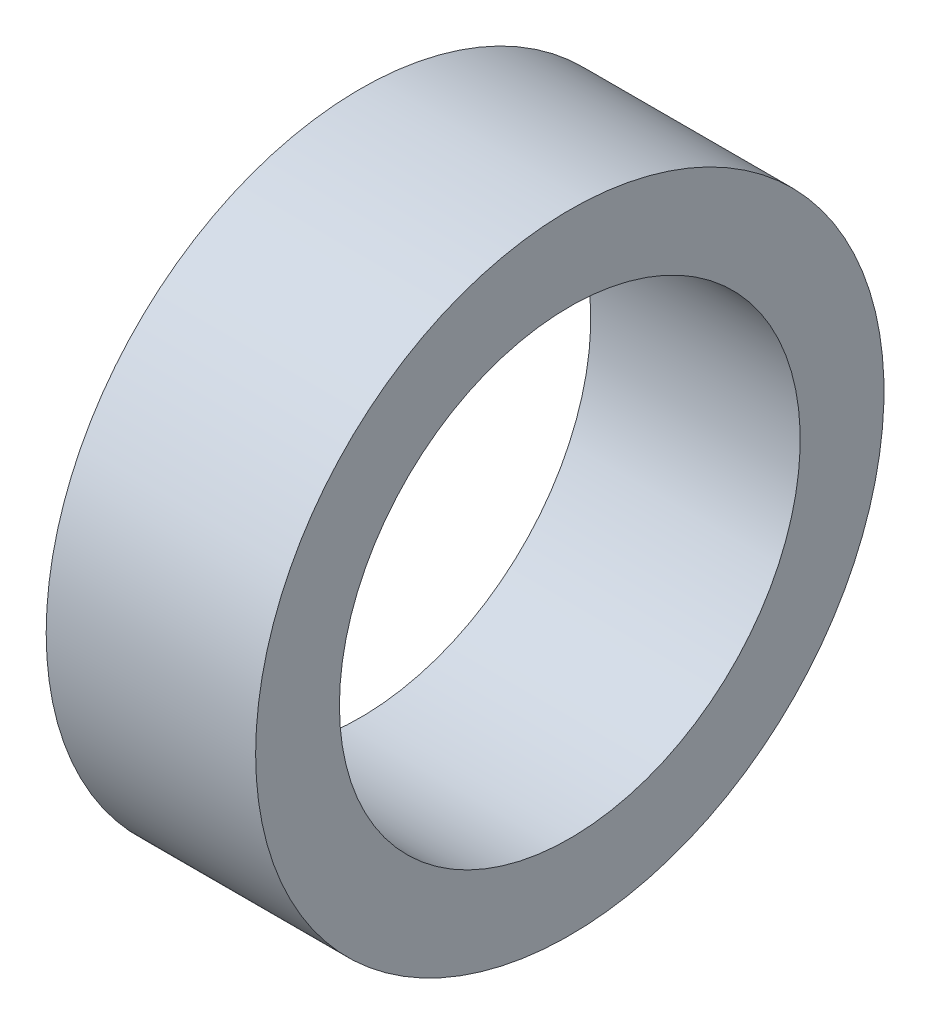
ISO-10303-21;
HEADER;
FILE_DESCRIPTION(('STEP AP214'),'2;1');
FILE_NAME('part.step','',(''),(''),'','','');
FILE_SCHEMA(('AUTOMOTIVE_DESIGN { 1 0 10303 214 1 1 1 1 }'));
ENDSEC;
DATA;
#1=APPLICATION_CONTEXT('core data for automotive mechanical design processes');
#2=APPLICATION_PROTOCOL_DEFINITION('international standard','automotive_design',2000,#1);
#3=PRODUCT_CONTEXT('',#1,'mechanical');
#4=PRODUCT('Part','Part','',(#3));
#5=PRODUCT_RELATED_PRODUCT_CATEGORY('part','',(#4));
#6=PRODUCT_DEFINITION_FORMATION('','',#4);
#7=PRODUCT_DEFINITION_CONTEXT('part definition',#1,'design');
#8=PRODUCT_DEFINITION('design','',#6,#7);
#9=PRODUCT_DEFINITION_SHAPE('','',#8);
#10=(LENGTH_UNIT() NAMED_UNIT(*) SI_UNIT(.MILLI.,.METRE.));
#11=(NAMED_UNIT(*) PLANE_ANGLE_UNIT() SI_UNIT($,.RADIAN.));
#12=(NAMED_UNIT(*) SI_UNIT($,.STERADIAN.) SOLID_ANGLE_UNIT());
#13=UNCERTAINTY_MEASURE_WITH_UNIT(LENGTH_MEASURE(1.E-05),#10,'distance_accuracy_value','');
#14=(GEOMETRIC_REPRESENTATION_CONTEXT(3) GLOBAL_UNCERTAINTY_ASSIGNED_CONTEXT((#13)) GLOBAL_UNIT_ASSIGNED_CONTEXT((#10,
#11,#12)) REPRESENTATION_CONTEXT('',''));
#15=CARTESIAN_POINT('',(0.,0.,0.));
#16=DIRECTION('',(0.,0.,1.));
#17=DIRECTION('',(1.,0.,0.));
#18=AXIS2_PLACEMENT_3D('',#15,#16,#17);
#19=CARTESIAN_POINT('',(-13.97,0.,0.));
#20=DIRECTION('',(-1.,0.,0.));
#21=DIRECTION('',(0.,0.,1.));
#22=AXIS2_PLACEMENT_3D('',#19,#20,#21);
#23=CYLINDRICAL_SURFACE('',#22,38.1);
#24=CARTESIAN_POINT('',(-12.7,0.,0.));
#25=DIRECTION('',(-1.,0.,0.));
#26=DIRECTION('',(0.,0.,1.));
#27=AXIS2_PLACEMENT_3D('',#24,#25,#26);
#28=CIRCLE('',#27,38.1);
#29=CARTESIAN_POINT('',(-12.7,0.,38.1));
#30=VERTEX_POINT('',#29);
#31=EDGE_CURVE('E10',#30,#30,#28,.T.);
#32=ORIENTED_EDGE('',*,*,#31,.F.);
#33=EDGE_LOOP('',(#32));
#34=FACE_BOUND('',#33,.T.);
#35=CARTESIAN_POINT('',(12.7,0.,0.));
#36=DIRECTION('',(-1.,0.,0.));
#37=DIRECTION('',(0.,0.,1.));
#38=AXIS2_PLACEMENT_3D('',#35,#36,#37);
#39=CIRCLE('',#38,38.1);
#40=CARTESIAN_POINT('',(12.7,0.,38.1));
#41=VERTEX_POINT('',#40);
#42=EDGE_CURVE('E53',#41,#41,#39,.T.);
#43=ORIENTED_EDGE('',*,*,#42,.T.);
#44=EDGE_LOOP('',(#43));
#45=FACE_BOUND('',#44,.T.);
#46=ADVANCED_FACE('F39',(#34,#45),#23,.T.);
#47=CARTESIAN_POINT('',(-12.7,0.,-38.1));
#48=DIRECTION('',(1.,0.,0.));
#49=DIRECTION('',(0.,0.,-1.));
#50=AXIS2_PLACEMENT_3D('',#47,#48,#49);
#51=PLANE('',#50);
#52=CARTESIAN_POINT('',(-12.7,0.,0.));
#53=DIRECTION('',(-1.,0.,0.));
#54=DIRECTION('',(0.,0.,1.));
#55=AXIS2_PLACEMENT_3D('',#52,#53,#54);
#56=CIRCLE('',#55,27.94);
#57=CARTESIAN_POINT('',(-12.7,0.,27.94));
#58=VERTEX_POINT('',#57);
#59=EDGE_CURVE('E45',#58,#58,#56,.T.);
#60=ORIENTED_EDGE('',*,*,#59,.F.);
#61=EDGE_LOOP('',(#60));
#62=FACE_BOUND('',#61,.T.);
#63=ORIENTED_EDGE('',*,*,#31,.T.);
#64=EDGE_LOOP('',(#63));
#65=FACE_BOUND('',#64,.T.);
#66=ADVANCED_FACE('F68',(#62,#65),#51,.F.);
#67=CARTESIAN_POINT('',(-13.97,0.,0.));
#68=DIRECTION('',(-1.,0.,0.));
#69=DIRECTION('',(0.,0.,1.));
#70=AXIS2_PLACEMENT_3D('',#67,#68,#69);
#71=CYLINDRICAL_SURFACE('',#70,27.94);
#72=CARTESIAN_POINT('',(12.7,0.,0.));
#73=DIRECTION('',(-1.,0.,0.));
#74=DIRECTION('',(0.,0.,1.));
#75=AXIS2_PLACEMENT_3D('',#72,#73,#74);
#76=CIRCLE('',#75,27.94);
#77=CARTESIAN_POINT('',(12.7,0.,27.94));
#78=VERTEX_POINT('',#77);
#79=EDGE_CURVE('E49',#78,#78,#76,.T.);
#80=ORIENTED_EDGE('',*,*,#79,.F.);
#81=EDGE_LOOP('',(#80));
#82=FACE_BOUND('',#81,.T.);
#83=ORIENTED_EDGE('',*,*,#59,.T.);
#84=EDGE_LOOP('',(#83));
#85=FACE_BOUND('',#84,.T.);
#86=ADVANCED_FACE('F63',(#82,#85),#71,.F.);
#87=CARTESIAN_POINT('',(12.7,0.,-27.94));
#88=DIRECTION('',(-1.,0.,0.));
#89=DIRECTION('',(0.,0.,1.));
#90=AXIS2_PLACEMENT_3D('',#87,#88,#89);
#91=PLANE('',#90);
#92=ORIENTED_EDGE('',*,*,#42,.F.);
#93=EDGE_LOOP('',(#92));
#94=FACE_BOUND('',#93,.T.);
#95=ORIENTED_EDGE('',*,*,#79,.T.);
#96=EDGE_LOOP('',(#95));
#97=FACE_BOUND('',#96,.T.);
#98=ADVANCED_FACE('F60',(#94,#97),#91,.F.);
#99=CLOSED_SHELL('',(#46,#66,#86,#98));
#100=MANIFOLD_SOLID_BREP('B2',#99);
#101=ADVANCED_BREP_SHAPE_REPRESENTATION('',(#18,#100),#14);
#102=SHAPE_DEFINITION_REPRESENTATION(#9,#101);
ENDSEC;
END-ISO-10303-21;
